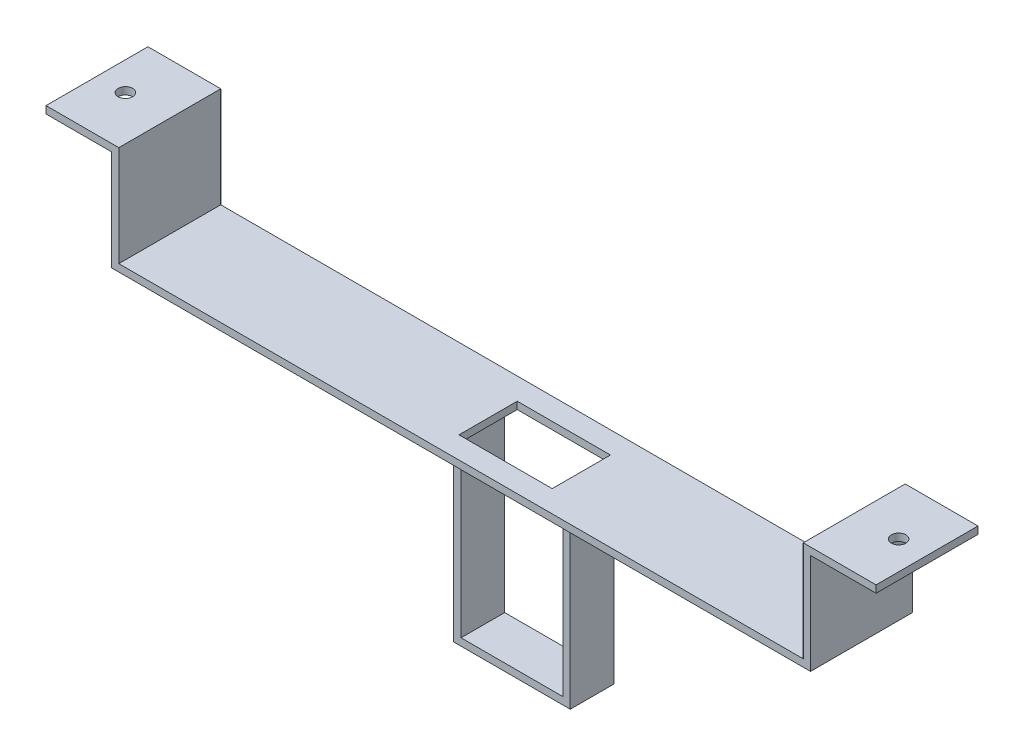
ISO-10303-21;
HEADER;
FILE_DESCRIPTION(('STEP AP214'),'2;1');
FILE_NAME('part.step','',(''),(''),'','','');
FILE_SCHEMA(('AUTOMOTIVE_DESIGN { 1 0 10303 214 1 1 1 1 }'));
ENDSEC;
DATA;
#1=APPLICATION_CONTEXT('core data for automotive mechanical design processes');
#2=APPLICATION_PROTOCOL_DEFINITION('international standard','automotive_design',2000,#1);
#3=PRODUCT_CONTEXT('',#1,'mechanical');
#4=PRODUCT('Part','Part','',(#3));
#5=PRODUCT_RELATED_PRODUCT_CATEGORY('part','',(#4));
#6=PRODUCT_DEFINITION_FORMATION('','',#4);
#7=PRODUCT_DEFINITION_CONTEXT('part definition',#1,'design');
#8=PRODUCT_DEFINITION('design','',#6,#7);
#9=PRODUCT_DEFINITION_SHAPE('','',#8);
#10=(LENGTH_UNIT() NAMED_UNIT(*) SI_UNIT(.MILLI.,.METRE.));
#11=(NAMED_UNIT(*) PLANE_ANGLE_UNIT() SI_UNIT($,.RADIAN.));
#12=(NAMED_UNIT(*) SI_UNIT($,.STERADIAN.) SOLID_ANGLE_UNIT());
#13=UNCERTAINTY_MEASURE_WITH_UNIT(LENGTH_MEASURE(1.E-05),#10,'distance_accuracy_value','');
#14=(GEOMETRIC_REPRESENTATION_CONTEXT(3) GLOBAL_UNCERTAINTY_ASSIGNED_CONTEXT((#13)) GLOBAL_UNIT_ASSIGNED_CONTEXT((#10,
#11,#12)) REPRESENTATION_CONTEXT('',''));
#15=CARTESIAN_POINT('',(0.,0.,0.));
#16=DIRECTION('',(0.,0.,1.));
#17=DIRECTION('',(1.,0.,0.));
#18=AXIS2_PLACEMENT_3D('',#15,#16,#17);
#19=CARTESIAN_POINT('',(0.,-2.5,35.));
#20=DIRECTION('',(0.,1.,0.));
#21=DIRECTION('',(0.,0.,1.));
#22=AXIS2_PLACEMENT_3D('',#19,#20,#21);
#23=PLANE('',#22);
#24=DIRECTION('',(1.,0.,0.));
#25=VECTOR('',#24,1.);
#26=CARTESIAN_POINT('',(-12.5,-2.5,25.));
#27=LINE('',#26,#25);
#28=CARTESIAN_POINT('',(-12.5,-2.5,25.));
#29=VERTEX_POINT('',#28);
#30=CARTESIAN_POINT('',(-10.,-2.5,25.));
#31=VERTEX_POINT('',#30);
#32=EDGE_CURVE('E217',#29,#31,#27,.T.);
#33=ORIENTED_EDGE('',*,*,#32,.T.);
#34=DIRECTION('',(0.,0.,-1.));
#35=VECTOR('',#34,1.);
#36=CARTESIAN_POINT('',(-10.,-2.5,25.));
#37=LINE('',#36,#35);
#38=CARTESIAN_POINT('',(-10.,-2.5,10.));
#39=VERTEX_POINT('',#38);
#40=EDGE_CURVE('E201',#31,#39,#37,.T.);
#41=ORIENTED_EDGE('',*,*,#40,.T.);
#42=DIRECTION('',(1.,0.,0.));
#43=VECTOR('',#42,1.);
#44=CARTESIAN_POINT('',(-12.5,-2.5,10.));
#45=LINE('',#44,#43);
#46=CARTESIAN_POINT('',(-12.5,-2.5,10.));
#47=VERTEX_POINT('',#46);
#48=EDGE_CURVE('E240',#47,#39,#45,.T.);
#49=ORIENTED_EDGE('',*,*,#48,.F.);
#50=DIRECTION('',(0.,0.,-1.));
#51=VECTOR('',#50,1.);
#52=CARTESIAN_POINT('',(-12.5,-2.5,25.));
#53=LINE('',#52,#51);
#54=EDGE_CURVE('E223',#29,#47,#53,.T.);
#55=ORIENTED_EDGE('',*,*,#54,.F.);
#56=EDGE_LOOP('',(#33,#41,#49,#55));
#57=FACE_BOUND('',#56,.T.);
#58=DIRECTION('',(-1.,0.,0.));
#59=VECTOR('',#58,1.);
#60=CARTESIAN_POINT('',(0.,-2.5,7.5));
#61=LINE('',#60,#59);
#62=CARTESIAN_POINT('',(23.8,-2.50000000000002,7.5));
#63=VERTEX_POINT('',#62);
#64=CARTESIAN_POINT('',(-8.20000000000001,-2.50000000000002,7.5));
#65=VERTEX_POINT('',#64);
#66=EDGE_CURVE('E46',#63,#65,#61,.T.);
#67=ORIENTED_EDGE('',*,*,#66,.T.);
#68=DIRECTION('',(0.,0.,1.));
#69=VECTOR('',#68,1.);
#70=CARTESIAN_POINT('',(-8.20000000000001,-2.5,35.));
#71=LINE('',#70,#69);
#72=CARTESIAN_POINT('',(-8.20000000000001,-2.50000000000002,27.5));
#73=VERTEX_POINT('',#72);
#74=EDGE_CURVE('E11',#65,#73,#71,.T.);
#75=ORIENTED_EDGE('',*,*,#74,.T.);
#76=DIRECTION('',(1.,0.,0.));
#77=VECTOR('',#76,1.);
#78=CARTESIAN_POINT('',(0.,-2.5,27.5));
#79=LINE('',#78,#77);
#80=CARTESIAN_POINT('',(23.8,-2.5,27.5));
#81=VERTEX_POINT('',#80);
#82=EDGE_CURVE('E387',#73,#81,#79,.T.);
#83=ORIENTED_EDGE('',*,*,#82,.T.);
#84=DIRECTION('',(0.,0.,-1.));
#85=VECTOR('',#84,1.);
#86=CARTESIAN_POINT('',(23.8,-2.5,35.));
#87=LINE('',#86,#85);
#88=EDGE_CURVE('E390',#81,#63,#87,.T.);
#89=ORIENTED_EDGE('',*,*,#88,.T.);
#90=EDGE_LOOP('',(#67,#75,#83,#89));
#91=FACE_BOUND('',#90,.T.);
#92=DIRECTION('',(1.,0.,0.));
#93=VECTOR('',#92,1.);
#94=CARTESIAN_POINT('',(0.,-2.5,0.));
#95=LINE('',#94,#93);
#96=CARTESIAN_POINT('',(-120.,-2.5,0.));
#97=VERTEX_POINT('',#96);
#98=CARTESIAN_POINT('',(120.,-2.5,0.));
#99=VERTEX_POINT('',#98);
#100=EDGE_CURVE('E347',#97,#99,#95,.T.);
#101=ORIENTED_EDGE('',*,*,#100,.T.);
#102=DIRECTION('',(0.,0.,-1.));
#103=VECTOR('',#102,1.);
#104=CARTESIAN_POINT('',(120.,-2.5,35.));
#105=LINE('',#104,#103);
#106=CARTESIAN_POINT('',(120.,-2.5,35.));
#107=VERTEX_POINT('',#106);
#108=EDGE_CURVE('E372',#107,#99,#105,.T.);
#109=ORIENTED_EDGE('',*,*,#108,.F.);
#110=DIRECTION('',(1.,0.,0.));
#111=VECTOR('',#110,1.);
#112=CARTESIAN_POINT('',(0.,-2.5,35.));
#113=LINE('',#112,#111);
#114=CARTESIAN_POINT('',(-120.,-2.5,35.));
#115=VERTEX_POINT('',#114);
#116=EDGE_CURVE('E314',#115,#107,#113,.T.);
#117=ORIENTED_EDGE('',*,*,#116,.F.);
#118=DIRECTION('',(0.,0.,-1.));
#119=VECTOR('',#118,1.);
#120=CARTESIAN_POINT('',(-120.,-2.5,35.));
#121=LINE('',#120,#119);
#122=EDGE_CURVE('E375',#115,#97,#121,.T.);
#123=ORIENTED_EDGE('',*,*,#122,.T.);
#124=EDGE_LOOP('',(#101,#109,#117,#123));
#125=FACE_BOUND('',#124,.T.);
#126=DIRECTION('',(1.,0.,0.));
#127=VECTOR('',#126,1.);
#128=CARTESIAN_POINT('',(25.,-2.5,25.));
#129=LINE('',#128,#127);
#130=CARTESIAN_POINT('',(25.,-2.5,25.));
#131=VERTEX_POINT('',#130);
#132=CARTESIAN_POINT('',(27.5,-2.5,25.));
#133=VERTEX_POINT('',#132);
#134=EDGE_CURVE('E231',#131,#133,#129,.T.);
#135=ORIENTED_EDGE('',*,*,#134,.T.);
#136=DIRECTION('',(0.,0.,-1.));
#137=VECTOR('',#136,1.);
#138=CARTESIAN_POINT('',(27.5,-2.5,25.));
#139=LINE('',#138,#137);
#140=CARTESIAN_POINT('',(27.5,-2.5,10.));
#141=VERTEX_POINT('',#140);
#142=EDGE_CURVE('E260',#133,#141,#139,.T.);
#143=ORIENTED_EDGE('',*,*,#142,.T.);
#144=DIRECTION('',(1.,0.,0.));
#145=VECTOR('',#144,1.);
#146=CARTESIAN_POINT('',(25.,-2.5,10.));
#147=LINE('',#146,#145);
#148=CARTESIAN_POINT('',(25.,-2.5,10.));
#149=VERTEX_POINT('',#148);
#150=EDGE_CURVE('E246',#149,#141,#147,.T.);
#151=ORIENTED_EDGE('',*,*,#150,.F.);
#152=DIRECTION('',(0.,0.,-1.));
#153=VECTOR('',#152,1.);
#154=CARTESIAN_POINT('',(25.,-2.5,25.));
#155=LINE('',#154,#153);
#156=EDGE_CURVE('E263',#131,#149,#155,.T.);
#157=ORIENTED_EDGE('',*,*,#156,.F.);
#158=EDGE_LOOP('',(#135,#143,#151,#157));
#159=FACE_BOUND('',#158,.T.);
#160=ADVANCED_FACE('F37',(#57,#91,#125,#159),#23,.F.);
#161=CARTESIAN_POINT('',(0.,0.,35.));
#162=DIRECTION('',(0.,1.,0.));
#163=DIRECTION('',(0.,0.,1.));
#164=AXIS2_PLACEMENT_3D('',#161,#162,#163);
#165=PLANE('',#164);
#166=DIRECTION('',(0.,0.,1.));
#167=VECTOR('',#166,1.);
#168=CARTESIAN_POINT('',(-8.20000000000001,0.,35.));
#169=LINE('',#168,#167);
#170=CARTESIAN_POINT('',(-8.20000000000001,0.,7.5));
#171=VERTEX_POINT('',#170);
#172=CARTESIAN_POINT('',(-8.20000000000001,0.,27.5));
#173=VERTEX_POINT('',#172);
#174=EDGE_CURVE('E293',#171,#173,#169,.T.);
#175=ORIENTED_EDGE('',*,*,#174,.F.);
#176=DIRECTION('',(-1.,0.,0.));
#177=VECTOR('',#176,1.);
#178=CARTESIAN_POINT('',(0.,0.,7.5));
#179=LINE('',#178,#177);
#180=CARTESIAN_POINT('',(23.8,0.,7.5));
#181=VERTEX_POINT('',#180);
#182=EDGE_CURVE('E291',#181,#171,#179,.T.);
#183=ORIENTED_EDGE('',*,*,#182,.F.);
#184=DIRECTION('',(0.,0.,-1.));
#185=VECTOR('',#184,1.);
#186=CARTESIAN_POINT('',(23.8,0.,35.));
#187=LINE('',#186,#185);
#188=CARTESIAN_POINT('',(23.8,0.,27.5));
#189=VERTEX_POINT('',#188);
#190=EDGE_CURVE('E289',#189,#181,#187,.T.);
#191=ORIENTED_EDGE('',*,*,#190,.F.);
#192=DIRECTION('',(1.,0.,0.));
#193=VECTOR('',#192,1.);
#194=CARTESIAN_POINT('',(0.,0.,27.5));
#195=LINE('',#194,#193);
#196=EDGE_CURVE('E279',#173,#189,#195,.T.);
#197=ORIENTED_EDGE('',*,*,#196,.F.);
#198=EDGE_LOOP('',(#175,#183,#191,#197));
#199=FACE_BOUND('',#198,.T.);
#200=DIRECTION('',(1.,0.,0.));
#201=VECTOR('',#200,1.);
#202=CARTESIAN_POINT('',(0.,0.,0.));
#203=LINE('',#202,#201);
#204=CARTESIAN_POINT('',(-117.5,0.,0.));
#205=VERTEX_POINT('',#204);
#206=CARTESIAN_POINT('',(117.5,0.,0.));
#207=VERTEX_POINT('',#206);
#208=EDGE_CURVE('E296',#205,#207,#203,.T.);
#209=ORIENTED_EDGE('',*,*,#208,.F.);
#210=DIRECTION('',(0.,0.,-1.));
#211=VECTOR('',#210,1.);
#212=CARTESIAN_POINT('',(-117.5,0.,35.));
#213=LINE('',#212,#211);
#214=CARTESIAN_POINT('',(-117.5,0.,35.));
#215=VERTEX_POINT('',#214);
#216=EDGE_CURVE('E385',#215,#205,#213,.T.);
#217=ORIENTED_EDGE('',*,*,#216,.F.);
#218=DIRECTION('',(1.,0.,0.));
#219=VECTOR('',#218,1.);
#220=CARTESIAN_POINT('',(0.,0.,35.));
#221=LINE('',#220,#219);
#222=CARTESIAN_POINT('',(117.5,0.,35.));
#223=VERTEX_POINT('',#222);
#224=EDGE_CURVE('E297',#215,#223,#221,.T.);
#225=ORIENTED_EDGE('',*,*,#224,.T.);
#226=DIRECTION('',(0.,0.,-1.));
#227=VECTOR('',#226,1.);
#228=CARTESIAN_POINT('',(117.5,0.,35.));
#229=LINE('',#228,#227);
#230=EDGE_CURVE('E329',#223,#207,#229,.T.);
#231=ORIENTED_EDGE('',*,*,#230,.T.);
#232=EDGE_LOOP('',(#209,#217,#225,#231));
#233=FACE_BOUND('',#232,.T.);
#234=ADVANCED_FACE('F39',(#199,#233),#165,.T.);
#235=CARTESIAN_POINT('',(-117.5,0.,35.));
#236=DIRECTION('',(-1.,0.,0.));
#237=DIRECTION('',(0.,0.,1.));
#238=AXIS2_PLACEMENT_3D('',#235,#236,#237);
#239=PLANE('',#238);
#240=DIRECTION('',(0.,1.,0.));
#241=VECTOR('',#240,1.);
#242=CARTESIAN_POINT('',(-117.5,0.,0.));
#243=LINE('',#242,#241);
#244=CARTESIAN_POINT('',(-117.5,34.5,0.));
#245=VERTEX_POINT('',#244);
#246=EDGE_CURVE('E332',#205,#245,#243,.T.);
#247=ORIENTED_EDGE('',*,*,#246,.T.);
#248=DIRECTION('',(0.,0.,-1.));
#249=VECTOR('',#248,1.);
#250=CARTESIAN_POINT('',(-117.5,34.5,35.));
#251=LINE('',#250,#249);
#252=CARTESIAN_POINT('',(-117.5,34.5,35.));
#253=VERTEX_POINT('',#252);
#254=EDGE_CURVE('E383',#253,#245,#251,.T.);
#255=ORIENTED_EDGE('',*,*,#254,.F.);
#256=DIRECTION('',(0.,1.,0.));
#257=VECTOR('',#256,1.);
#258=CARTESIAN_POINT('',(-117.5,0.,35.));
#259=LINE('',#258,#257);
#260=EDGE_CURVE('E300',#215,#253,#259,.T.);
#261=ORIENTED_EDGE('',*,*,#260,.F.);
#262=ORIENTED_EDGE('',*,*,#216,.T.);
#263=EDGE_LOOP('',(#247,#255,#261,#262));
#264=FACE_BOUND('',#263,.T.);
#265=ADVANCED_FACE('F430',(#264),#239,.F.);
#266=CARTESIAN_POINT('',(0.,34.5,35.));
#267=DIRECTION('',(0.,1.,0.));
#268=DIRECTION('',(0.,0.,1.));
#269=AXIS2_PLACEMENT_3D('',#266,#267,#268);
#270=PLANE('',#269);
#271=CARTESIAN_POINT('',(-132.75,34.5,17.5));
#272=DIRECTION('',(0.,1.,0.));
#273=DIRECTION('',(0.,0.,1.));
#274=AXIS2_PLACEMENT_3D('',#271,#272,#273);
#275=CIRCLE('',#274,2.5);
#276=CARTESIAN_POINT('',(-132.75,34.5,20.));
#277=VERTEX_POINT('',#276);
#278=EDGE_CURVE('E268',#277,#277,#275,.T.);
#279=ORIENTED_EDGE('',*,*,#278,.F.);
#280=EDGE_LOOP('',(#279));
#281=FACE_BOUND('',#280,.T.);
#282=DIRECTION('',(1.,0.,0.));
#283=VECTOR('',#282,1.);
#284=CARTESIAN_POINT('',(0.,34.5,0.));
#285=LINE('',#284,#283);
#286=CARTESIAN_POINT('',(-142.5,34.5,0.));
#287=VERTEX_POINT('',#286);
#288=EDGE_CURVE('E335',#287,#245,#285,.T.);
#289=ORIENTED_EDGE('',*,*,#288,.F.);
#290=DIRECTION('',(0.,0.,-1.));
#291=VECTOR('',#290,1.);
#292=CARTESIAN_POINT('',(-142.5,34.5,35.));
#293=LINE('',#292,#291);
#294=CARTESIAN_POINT('',(-142.5,34.5,35.));
#295=VERTEX_POINT('',#294);
#296=EDGE_CURVE('E381',#295,#287,#293,.T.);
#297=ORIENTED_EDGE('',*,*,#296,.F.);
#298=DIRECTION('',(1.,0.,0.));
#299=VECTOR('',#298,1.);
#300=CARTESIAN_POINT('',(0.,34.5,35.));
#301=LINE('',#300,#299);
#302=EDGE_CURVE('E303',#295,#253,#301,.T.);
#303=ORIENTED_EDGE('',*,*,#302,.T.);
#304=ORIENTED_EDGE('',*,*,#254,.T.);
#305=EDGE_LOOP('',(#289,#297,#303,#304));
#306=FACE_BOUND('',#305,.T.);
#307=ADVANCED_FACE('F446',(#281,#306),#270,.T.);
#308=CARTESIAN_POINT('',(-142.5,-1.58206781009084E-12,35.));
#309=DIRECTION('',(1.,0.,0.));
#310=DIRECTION('',(0.,1.,0.));
#311=AXIS2_PLACEMENT_3D('',#308,#309,#310);
#312=PLANE('',#311);
#313=DIRECTION('',(0.,-1.,0.));
#314=VECTOR('',#313,1.);
#315=CARTESIAN_POINT('',(-142.5,-1.58206781009084E-12,0.));
#316=LINE('',#315,#314);
#317=CARTESIAN_POINT('',(-142.5,32.,0.));
#318=VERTEX_POINT('',#317);
#319=EDGE_CURVE('E338',#287,#318,#316,.T.);
#320=ORIENTED_EDGE('',*,*,#319,.T.);
#321=DIRECTION('',(0.,0.,-1.));
#322=VECTOR('',#321,1.);
#323=CARTESIAN_POINT('',(-142.5,32.,35.));
#324=LINE('',#323,#322);
#325=CARTESIAN_POINT('',(-142.5,32.,35.));
#326=VERTEX_POINT('',#325);
#327=EDGE_CURVE('E379',#326,#318,#324,.T.);
#328=ORIENTED_EDGE('',*,*,#327,.F.);
#329=DIRECTION('',(0.,-1.,0.));
#330=VECTOR('',#329,1.);
#331=CARTESIAN_POINT('',(-142.5,-1.58206781009084E-12,35.));
#332=LINE('',#331,#330);
#333=EDGE_CURVE('E306',#295,#326,#332,.T.);
#334=ORIENTED_EDGE('',*,*,#333,.F.);
#335=ORIENTED_EDGE('',*,*,#296,.T.);
#336=EDGE_LOOP('',(#320,#328,#334,#335));
#337=FACE_BOUND('',#336,.T.);
#338=ADVANCED_FACE('F442',(#337),#312,.F.);
#339=CARTESIAN_POINT('',(0.,32.,35.));
#340=DIRECTION('',(0.,-1.,0.));
#341=DIRECTION('',(0.,0.,-1.));
#342=AXIS2_PLACEMENT_3D('',#339,#340,#341);
#343=PLANE('',#342);
#344=CARTESIAN_POINT('',(-132.75,32.,17.5));
#345=DIRECTION('',(0.,-1.,0.));
#346=DIRECTION('',(0.,0.,-1.));
#347=AXIS2_PLACEMENT_3D('',#344,#345,#346);
#348=CIRCLE('',#347,2.5);
#349=CARTESIAN_POINT('',(-132.75,32.,15.));
#350=VERTEX_POINT('',#349);
#351=EDGE_CURVE('E41',#350,#350,#348,.T.);
#352=ORIENTED_EDGE('',*,*,#351,.F.);
#353=EDGE_LOOP('',(#352));
#354=FACE_BOUND('',#353,.T.);
#355=DIRECTION('',(-1.,0.,0.));
#356=VECTOR('',#355,1.);
#357=CARTESIAN_POINT('',(0.,32.,0.));
#358=LINE('',#357,#356);
#359=CARTESIAN_POINT('',(-120.,32.,0.));
#360=VERTEX_POINT('',#359);
#361=EDGE_CURVE('E341',#360,#318,#358,.T.);
#362=ORIENTED_EDGE('',*,*,#361,.F.);
#363=DIRECTION('',(0.,0.,-1.));
#364=VECTOR('',#363,1.);
#365=CARTESIAN_POINT('',(-120.,32.,35.));
#366=LINE('',#365,#364);
#367=CARTESIAN_POINT('',(-120.,32.,35.));
#368=VERTEX_POINT('',#367);
#369=EDGE_CURVE('E377',#368,#360,#366,.T.);
#370=ORIENTED_EDGE('',*,*,#369,.F.);
#371=DIRECTION('',(-1.,0.,0.));
#372=VECTOR('',#371,1.);
#373=CARTESIAN_POINT('',(0.,32.,35.));
#374=LINE('',#373,#372);
#375=EDGE_CURVE('E308',#368,#326,#374,.T.);
#376=ORIENTED_EDGE('',*,*,#375,.T.);
#377=ORIENTED_EDGE('',*,*,#327,.T.);
#378=EDGE_LOOP('',(#362,#370,#376,#377));
#379=FACE_BOUND('',#378,.T.);
#380=ADVANCED_FACE('F438',(#354,#379),#343,.T.);
#381=CARTESIAN_POINT('',(-120.,1.44811698864151E-13,35.));
#382=DIRECTION('',(-1.,0.,0.));
#383=DIRECTION('',(0.,-1.,0.));
#384=AXIS2_PLACEMENT_3D('',#381,#382,#383);
#385=PLANE('',#384);
#386=DIRECTION('',(0.,1.,0.));
#387=VECTOR('',#386,1.);
#388=CARTESIAN_POINT('',(-120.,1.44811698864151E-13,0.));
#389=LINE('',#388,#387);
#390=EDGE_CURVE('E344',#97,#360,#389,.T.);
#391=ORIENTED_EDGE('',*,*,#390,.F.);
#392=ORIENTED_EDGE('',*,*,#122,.F.);
#393=DIRECTION('',(0.,1.,0.));
#394=VECTOR('',#393,1.);
#395=CARTESIAN_POINT('',(-120.,1.44811698864151E-13,35.));
#396=LINE('',#395,#394);
#397=EDGE_CURVE('E311',#115,#368,#396,.T.);
#398=ORIENTED_EDGE('',*,*,#397,.T.);
#399=ORIENTED_EDGE('',*,*,#369,.T.);
#400=EDGE_LOOP('',(#391,#392,#398,#399));
#401=FACE_BOUND('',#400,.T.);
#402=ADVANCED_FACE('F435',(#401),#385,.T.);
#403=CARTESIAN_POINT('',(120.,2.89623397728302E-13,35.));
#404=DIRECTION('',(-1.,0.,0.));
#405=DIRECTION('',(0.,-1.,0.));
#406=AXIS2_PLACEMENT_3D('',#403,#404,#405);
#407=PLANE('',#406);
#408=DIRECTION('',(0.,1.,0.));
#409=VECTOR('',#408,1.);
#410=CARTESIAN_POINT('',(120.,2.89623397728302E-13,0.));
#411=LINE('',#410,#409);
#412=CARTESIAN_POINT('',(120.,32.,0.));
#413=VERTEX_POINT('',#412);
#414=EDGE_CURVE('E349',#99,#413,#411,.T.);
#415=ORIENTED_EDGE('',*,*,#414,.T.);
#416=DIRECTION('',(0.,0.,-1.));
#417=VECTOR('',#416,1.);
#418=CARTESIAN_POINT('',(120.,32.,35.));
#419=LINE('',#418,#417);
#420=CARTESIAN_POINT('',(120.,32.,35.));
#421=VERTEX_POINT('',#420);
#422=EDGE_CURVE('E369',#421,#413,#419,.T.);
#423=ORIENTED_EDGE('',*,*,#422,.F.);
#424=DIRECTION('',(0.,1.,0.));
#425=VECTOR('',#424,1.);
#426=CARTESIAN_POINT('',(120.,2.89623397728302E-13,35.));
#427=LINE('',#426,#425);
#428=EDGE_CURVE('E316',#107,#421,#427,.T.);
#429=ORIENTED_EDGE('',*,*,#428,.F.);
#430=ORIENTED_EDGE('',*,*,#108,.T.);
#431=EDGE_LOOP('',(#415,#423,#429,#430));
#432=FACE_BOUND('',#431,.T.);
#433=ADVANCED_FACE('F433',(#432),#407,.F.);
#434=CARTESIAN_POINT('',(0.,32.,35.));
#435=DIRECTION('',(0.,1.,0.));
#436=DIRECTION('',(0.,0.,1.));
#437=AXIS2_PLACEMENT_3D('',#434,#435,#436);
#438=PLANE('',#437);
#439=CARTESIAN_POINT('',(132.75,32.,17.5000000000003));
#440=DIRECTION('',(0.,1.,0.));
#441=DIRECTION('',(0.,0.,1.));
#442=AXIS2_PLACEMENT_3D('',#439,#440,#441);
#443=CIRCLE('',#442,2.5);
#444=CARTESIAN_POINT('',(132.75,32.,20.0000000000003));
#445=VERTEX_POINT('',#444);
#446=EDGE_CURVE('E271',#445,#445,#443,.T.);
#447=ORIENTED_EDGE('',*,*,#446,.T.);
#448=EDGE_LOOP('',(#447));
#449=FACE_BOUND('',#448,.T.);
#450=DIRECTION('',(1.,0.,0.));
#451=VECTOR('',#450,1.);
#452=CARTESIAN_POINT('',(0.,32.,0.));
#453=LINE('',#452,#451);
#454=CARTESIAN_POINT('',(142.5,32.,0.));
#455=VERTEX_POINT('',#454);
#456=EDGE_CURVE('E351',#413,#455,#453,.T.);
#457=ORIENTED_EDGE('',*,*,#456,.T.);
#458=DIRECTION('',(0.,0.,-1.));
#459=VECTOR('',#458,1.);
#460=CARTESIAN_POINT('',(142.5,32.,35.));
#461=LINE('',#460,#459);
#462=CARTESIAN_POINT('',(142.5,32.,35.));
#463=VERTEX_POINT('',#462);
#464=EDGE_CURVE('E367',#463,#455,#461,.T.);
#465=ORIENTED_EDGE('',*,*,#464,.F.);
#466=DIRECTION('',(1.,0.,0.));
#467=VECTOR('',#466,1.);
#468=CARTESIAN_POINT('',(0.,32.,35.));
#469=LINE('',#468,#467);
#470=EDGE_CURVE('E318',#421,#463,#469,.T.);
#471=ORIENTED_EDGE('',*,*,#470,.F.);
#472=ORIENTED_EDGE('',*,*,#422,.T.);
#473=EDGE_LOOP('',(#457,#465,#471,#472));
#474=FACE_BOUND('',#473,.T.);
#475=ADVANCED_FACE('F487',(#449,#474),#438,.F.);
#476=CARTESIAN_POINT('',(142.499999999999,-4.7462034302725E-12,35.));
#477=DIRECTION('',(1.,0.,0.));
#478=DIRECTION('',(0.,1.,0.));
#479=AXIS2_PLACEMENT_3D('',#476,#477,#478);
#480=PLANE('',#479);
#481=DIRECTION('',(0.,-1.,0.));
#482=VECTOR('',#481,1.);
#483=CARTESIAN_POINT('',(142.499999999999,-4.7462034302725E-12,0.));
#484=LINE('',#483,#482);
#485=CARTESIAN_POINT('',(142.5,34.5,0.));
#486=VERTEX_POINT('',#485);
#487=EDGE_CURVE('E354',#486,#455,#484,.T.);
#488=ORIENTED_EDGE('',*,*,#487,.F.);
#489=DIRECTION('',(0.,0.,-1.));
#490=VECTOR('',#489,1.);
#491=CARTESIAN_POINT('',(142.5,34.5,35.));
#492=LINE('',#491,#490);
#493=CARTESIAN_POINT('',(142.5,34.5,35.));
#494=VERTEX_POINT('',#493);
#495=EDGE_CURVE('E365',#494,#486,#492,.T.);
#496=ORIENTED_EDGE('',*,*,#495,.F.);
#497=DIRECTION('',(0.,-1.,0.));
#498=VECTOR('',#497,1.);
#499=CARTESIAN_POINT('',(142.499999999999,-4.7462034302725E-12,35.));
#500=LINE('',#499,#498);
#501=EDGE_CURVE('E320',#494,#463,#500,.T.);
#502=ORIENTED_EDGE('',*,*,#501,.T.);
#503=ORIENTED_EDGE('',*,*,#464,.T.);
#504=EDGE_LOOP('',(#488,#496,#502,#503));
#505=FACE_BOUND('',#504,.T.);
#506=ADVANCED_FACE('F482',(#505),#480,.T.);
#507=CARTESIAN_POINT('',(0.,34.5,35.));
#508=DIRECTION('',(0.,1.,0.));
#509=DIRECTION('',(0.,0.,1.));
#510=AXIS2_PLACEMENT_3D('',#507,#508,#509);
#511=PLANE('',#510);
#512=CARTESIAN_POINT('',(132.75,34.5,17.5000000000003));
#513=DIRECTION('',(0.,1.,0.));
#514=DIRECTION('',(0.,0.,-1.));
#515=AXIS2_PLACEMENT_3D('',#512,#513,#514);
#516=CIRCLE('',#515,2.5);
#517=CARTESIAN_POINT('',(132.75,34.5,15.0000000000003));
#518=VERTEX_POINT('',#517);
#519=EDGE_CURVE('E254',#518,#518,#516,.T.);
#520=ORIENTED_EDGE('',*,*,#519,.F.);
#521=EDGE_LOOP('',(#520));
#522=FACE_BOUND('',#521,.T.);
#523=DIRECTION('',(1.,0.,0.));
#524=VECTOR('',#523,1.);
#525=CARTESIAN_POINT('',(0.,34.5,0.));
#526=LINE('',#525,#524);
#527=CARTESIAN_POINT('',(117.5,34.5,0.));
#528=VERTEX_POINT('',#527);
#529=EDGE_CURVE('E357',#528,#486,#526,.T.);
#530=ORIENTED_EDGE('',*,*,#529,.F.);
#531=DIRECTION('',(0.,0.,-1.));
#532=VECTOR('',#531,1.);
#533=CARTESIAN_POINT('',(117.5,34.5,35.));
#534=LINE('',#533,#532);
#535=CARTESIAN_POINT('',(117.5,34.5,35.));
#536=VERTEX_POINT('',#535);
#537=EDGE_CURVE('E363',#536,#528,#534,.T.);
#538=ORIENTED_EDGE('',*,*,#537,.F.);
#539=DIRECTION('',(1.,0.,0.));
#540=VECTOR('',#539,1.);
#541=CARTESIAN_POINT('',(0.,34.5,35.));
#542=LINE('',#541,#540);
#543=EDGE_CURVE('E323',#536,#494,#542,.T.);
#544=ORIENTED_EDGE('',*,*,#543,.T.);
#545=ORIENTED_EDGE('',*,*,#495,.T.);
#546=EDGE_LOOP('',(#530,#538,#544,#545));
#547=FACE_BOUND('',#546,.T.);
#548=ADVANCED_FACE('F477',(#522,#547),#511,.T.);
#549=CARTESIAN_POINT('',(117.5,0.,35.));
#550=DIRECTION('',(-1.,0.,0.));
#551=DIRECTION('',(0.,0.,1.));
#552=AXIS2_PLACEMENT_3D('',#549,#550,#551);
#553=PLANE('',#552);
#554=DIRECTION('',(0.,1.,0.));
#555=VECTOR('',#554,1.);
#556=CARTESIAN_POINT('',(117.5,0.,0.));
#557=LINE('',#556,#555);
#558=EDGE_CURVE('E301',#207,#528,#557,.T.);
#559=ORIENTED_EDGE('',*,*,#558,.F.);
#560=ORIENTED_EDGE('',*,*,#230,.F.);
#561=DIRECTION('',(0.,1.,0.));
#562=VECTOR('',#561,1.);
#563=CARTESIAN_POINT('',(117.5,0.,35.));
#564=LINE('',#563,#562);
#565=EDGE_CURVE('E326',#223,#536,#564,.T.);
#566=ORIENTED_EDGE('',*,*,#565,.T.);
#567=ORIENTED_EDGE('',*,*,#537,.T.);
#568=EDGE_LOOP('',(#559,#560,#566,#567));
#569=FACE_BOUND('',#568,.T.);
#570=ADVANCED_FACE('F474',(#569),#553,.T.);
#571=CARTESIAN_POINT('',(0.,0.,35.));
#572=DIRECTION('',(0.,0.,1.));
#573=DIRECTION('',(1.,0.,0.));
#574=AXIS2_PLACEMENT_3D('',#571,#572,#573);
#575=PLANE('',#574);
#576=ORIENTED_EDGE('',*,*,#224,.F.);
#577=ORIENTED_EDGE('',*,*,#260,.T.);
#578=ORIENTED_EDGE('',*,*,#302,.F.);
#579=ORIENTED_EDGE('',*,*,#333,.T.);
#580=ORIENTED_EDGE('',*,*,#375,.F.);
#581=ORIENTED_EDGE('',*,*,#397,.F.);
#582=ORIENTED_EDGE('',*,*,#116,.T.);
#583=ORIENTED_EDGE('',*,*,#428,.T.);
#584=ORIENTED_EDGE('',*,*,#470,.T.);
#585=ORIENTED_EDGE('',*,*,#501,.F.);
#586=ORIENTED_EDGE('',*,*,#543,.F.);
#587=ORIENTED_EDGE('',*,*,#565,.F.);
#588=EDGE_LOOP('',(#576,#577,#578,#579,#580,#581,#582,#583,#584,#585,#586,#587));
#589=FACE_BOUND('',#588,.T.);
#590=ADVANCED_FACE('F467',(#589),#575,.T.);
#591=CARTESIAN_POINT('',(0.,0.,0.));
#592=DIRECTION('',(0.,0.,1.));
#593=DIRECTION('',(1.,0.,0.));
#594=AXIS2_PLACEMENT_3D('',#591,#592,#593);
#595=PLANE('',#594);
#596=ORIENTED_EDGE('',*,*,#208,.T.);
#597=ORIENTED_EDGE('',*,*,#558,.T.);
#598=ORIENTED_EDGE('',*,*,#529,.T.);
#599=ORIENTED_EDGE('',*,*,#487,.T.);
#600=ORIENTED_EDGE('',*,*,#456,.F.);
#601=ORIENTED_EDGE('',*,*,#414,.F.);
#602=ORIENTED_EDGE('',*,*,#100,.F.);
#603=ORIENTED_EDGE('',*,*,#390,.T.);
#604=ORIENTED_EDGE('',*,*,#361,.T.);
#605=ORIENTED_EDGE('',*,*,#319,.F.);
#606=ORIENTED_EDGE('',*,*,#288,.T.);
#607=ORIENTED_EDGE('',*,*,#246,.F.);
#608=EDGE_LOOP('',(#596,#597,#598,#599,#600,#601,#602,#603,#604,#605,#606,#607));
#609=FACE_BOUND('',#608,.T.);
#610=ADVANCED_FACE('F461',(#609),#595,.F.);
#611=CARTESIAN_POINT('',(-8.20000000000001,-55.5,7.5));
#612=DIRECTION('',(-1.,0.,0.));
#613=DIRECTION('',(0.,0.,1.));
#614=AXIS2_PLACEMENT_3D('',#611,#612,#613);
#615=PLANE('',#614);
#616=ORIENTED_EDGE('',*,*,#174,.T.);
#617=DIRECTION('',(0.,1.,0.));
#618=VECTOR('',#617,1.);
#619=CARTESIAN_POINT('',(-8.20000000000001,-55.5,27.5));
#620=LINE('',#619,#618);
#621=EDGE_CURVE('E286',#73,#173,#620,.T.);
#622=ORIENTED_EDGE('',*,*,#621,.F.);
#623=ORIENTED_EDGE('',*,*,#74,.F.);
#624=DIRECTION('',(0.,1.,0.));
#625=VECTOR('',#624,1.);
#626=CARTESIAN_POINT('',(-8.20000000000001,-55.5,7.5));
#627=LINE('',#626,#625);
#628=EDGE_CURVE('E276',#65,#171,#627,.T.);
#629=ORIENTED_EDGE('',*,*,#628,.T.);
#630=EDGE_LOOP('',(#616,#622,#623,#629));
#631=FACE_BOUND('',#630,.T.);
#632=ADVANCED_FACE('F409',(#631),#615,.F.);
#633=CARTESIAN_POINT('',(-8.20000000000001,-55.5,7.5));
#634=DIRECTION('',(0.,0.,-1.));
#635=DIRECTION('',(-1.,0.,0.));
#636=AXIS2_PLACEMENT_3D('',#633,#634,#635);
#637=PLANE('',#636);
#638=ORIENTED_EDGE('',*,*,#182,.T.);
#639=ORIENTED_EDGE('',*,*,#628,.F.);
#640=ORIENTED_EDGE('',*,*,#66,.F.);
#641=DIRECTION('',(0.,1.,0.));
#642=VECTOR('',#641,1.);
#643=CARTESIAN_POINT('',(23.8,-55.5,7.5));
#644=LINE('',#643,#642);
#645=EDGE_CURVE('E280',#63,#181,#644,.T.);
#646=ORIENTED_EDGE('',*,*,#645,.T.);
#647=EDGE_LOOP('',(#638,#639,#640,#646));
#648=FACE_BOUND('',#647,.T.);
#649=ADVANCED_FACE('F399',(#648),#637,.F.);
#650=CARTESIAN_POINT('',(23.8,-55.5,7.5));
#651=DIRECTION('',(1.,0.,0.));
#652=DIRECTION('',(0.,0.,-1.));
#653=AXIS2_PLACEMENT_3D('',#650,#651,#652);
#654=PLANE('',#653);
#655=ORIENTED_EDGE('',*,*,#190,.T.);
#656=ORIENTED_EDGE('',*,*,#645,.F.);
#657=ORIENTED_EDGE('',*,*,#88,.F.);
#658=DIRECTION('',(0.,1.,0.));
#659=VECTOR('',#658,1.);
#660=CARTESIAN_POINT('',(23.8,-55.5,27.5));
#661=LINE('',#660,#659);
#662=EDGE_CURVE('E283',#81,#189,#661,.T.);
#663=ORIENTED_EDGE('',*,*,#662,.T.);
#664=EDGE_LOOP('',(#655,#656,#657,#663));
#665=FACE_BOUND('',#664,.T.);
#666=ADVANCED_FACE('F402',(#665),#654,.F.);
#667=CARTESIAN_POINT('',(-8.20000000000001,-55.5,27.5));
#668=DIRECTION('',(0.,0.,1.));
#669=DIRECTION('',(1.,0.,0.));
#670=AXIS2_PLACEMENT_3D('',#667,#668,#669);
#671=PLANE('',#670);
#672=ORIENTED_EDGE('',*,*,#196,.T.);
#673=ORIENTED_EDGE('',*,*,#662,.F.);
#674=ORIENTED_EDGE('',*,*,#82,.F.);
#675=ORIENTED_EDGE('',*,*,#621,.T.);
#676=EDGE_LOOP('',(#672,#673,#674,#675));
#677=FACE_BOUND('',#676,.T.);
#678=ADVANCED_FACE('F412',(#677),#671,.F.);
#679=CARTESIAN_POINT('',(132.75,-55.5,17.5000000000003));
#680=DIRECTION('',(0.,1.,0.));
#681=DIRECTION('',(0.,0.,1.));
#682=AXIS2_PLACEMENT_3D('',#679,#680,#681);
#683=CYLINDRICAL_SURFACE('',#682,2.5);
#684=ORIENTED_EDGE('',*,*,#519,.T.);
#685=EDGE_LOOP('',(#684));
#686=FACE_BOUND('',#685,.T.);
#687=ORIENTED_EDGE('',*,*,#446,.F.);
#688=EDGE_LOOP('',(#687));
#689=FACE_BOUND('',#688,.T.);
#690=ADVANCED_FACE('F414',(#686,#689),#683,.F.);
#691=CARTESIAN_POINT('',(-132.75,-55.5,17.5));
#692=DIRECTION('',(0.,1.,0.));
#693=DIRECTION('',(0.,0.,1.));
#694=AXIS2_PLACEMENT_3D('',#691,#692,#693);
#695=CYLINDRICAL_SURFACE('',#694,2.5);
#696=ORIENTED_EDGE('',*,*,#351,.T.);
#697=EDGE_LOOP('',(#696));
#698=FACE_BOUND('',#697,.T.);
#699=ORIENTED_EDGE('',*,*,#278,.T.);
#700=EDGE_LOOP('',(#699));
#701=FACE_BOUND('',#700,.T.);
#702=ADVANCED_FACE('F420',(#698,#701),#695,.F.);
#703=CARTESIAN_POINT('',(-12.5,-2.5,25.));
#704=DIRECTION('',(1.,0.,0.));
#705=DIRECTION('',(0.,1.,0.));
#706=AXIS2_PLACEMENT_3D('',#703,#704,#705);
#707=PLANE('',#706);
#708=DIRECTION('',(0.,-1.,0.));
#709=VECTOR('',#708,1.);
#710=CARTESIAN_POINT('',(-12.5,-2.5,10.));
#711=LINE('',#710,#709);
#712=CARTESIAN_POINT('',(-12.5,-65.,10.));
#713=VERTEX_POINT('',#712);
#714=EDGE_CURVE('E60',#47,#713,#711,.T.);
#715=ORIENTED_EDGE('',*,*,#714,.T.);
#716=DIRECTION('',(0.,0.,-1.));
#717=VECTOR('',#716,1.);
#718=CARTESIAN_POINT('',(-12.5,-65.,25.));
#719=LINE('',#718,#717);
#720=CARTESIAN_POINT('',(-12.5,-65.,25.));
#721=VERTEX_POINT('',#720);
#722=EDGE_CURVE('E255',#721,#713,#719,.T.);
#723=ORIENTED_EDGE('',*,*,#722,.F.);
#724=DIRECTION('',(0.,-1.,0.));
#725=VECTOR('',#724,1.);
#726=CARTESIAN_POINT('',(-12.5,-2.5,25.));
#727=LINE('',#726,#725);
#728=EDGE_CURVE('E211',#29,#721,#727,.T.);
#729=ORIENTED_EDGE('',*,*,#728,.F.);
#730=ORIENTED_EDGE('',*,*,#54,.T.);
#731=EDGE_LOOP('',(#715,#723,#729,#730));
#732=FACE_BOUND('',#731,.T.);
#733=ADVANCED_FACE('F516',(#732),#707,.F.);
#734=CARTESIAN_POINT('',(-12.5,-65.,25.));
#735=DIRECTION('',(0.,1.,0.));
#736=DIRECTION('',(0.,0.,1.));
#737=AXIS2_PLACEMENT_3D('',#734,#735,#736);
#738=PLANE('',#737);
#739=DIRECTION('',(1.,0.,0.));
#740=VECTOR('',#739,1.);
#741=CARTESIAN_POINT('',(-12.5,-65.,10.));
#742=LINE('',#741,#740);
#743=CARTESIAN_POINT('',(27.5,-65.,10.));
#744=VERTEX_POINT('',#743);
#745=EDGE_CURVE('E225',#713,#744,#742,.T.);
#746=ORIENTED_EDGE('',*,*,#745,.T.);
#747=DIRECTION('',(0.,0.,-1.));
#748=VECTOR('',#747,1.);
#749=CARTESIAN_POINT('',(27.5,-65.,25.));
#750=LINE('',#749,#748);
#751=CARTESIAN_POINT('',(27.5,-65.,25.));
#752=VERTEX_POINT('',#751);
#753=EDGE_CURVE('E258',#752,#744,#750,.T.);
#754=ORIENTED_EDGE('',*,*,#753,.F.);
#755=DIRECTION('',(1.,0.,0.));
#756=VECTOR('',#755,1.);
#757=CARTESIAN_POINT('',(-12.5,-65.,25.));
#758=LINE('',#757,#756);
#759=EDGE_CURVE('E237',#721,#752,#758,.T.);
#760=ORIENTED_EDGE('',*,*,#759,.F.);
#761=ORIENTED_EDGE('',*,*,#722,.T.);
#762=EDGE_LOOP('',(#746,#754,#760,#761));
#763=FACE_BOUND('',#762,.T.);
#764=ADVANCED_FACE('F519',(#763),#738,.F.);
#765=CARTESIAN_POINT('',(27.5,-2.5,25.));
#766=DIRECTION('',(1.,0.,0.));
#767=DIRECTION('',(0.,1.,0.));
#768=AXIS2_PLACEMENT_3D('',#765,#766,#767);
#769=PLANE('',#768);
#770=DIRECTION('',(0.,-1.,0.));
#771=VECTOR('',#770,1.);
#772=CARTESIAN_POINT('',(27.5,-2.5,10.));
#773=LINE('',#772,#771);
#774=EDGE_CURVE('E248',#141,#744,#773,.T.);
#775=ORIENTED_EDGE('',*,*,#774,.F.);
#776=ORIENTED_EDGE('',*,*,#142,.F.);
#777=DIRECTION('',(0.,-1.,0.));
#778=VECTOR('',#777,1.);
#779=CARTESIAN_POINT('',(27.5,-2.5,25.));
#780=LINE('',#779,#778);
#781=EDGE_CURVE('E234',#133,#752,#780,.T.);
#782=ORIENTED_EDGE('',*,*,#781,.T.);
#783=ORIENTED_EDGE('',*,*,#753,.T.);
#784=EDGE_LOOP('',(#775,#776,#782,#783));
#785=FACE_BOUND('',#784,.T.);
#786=ADVANCED_FACE('F507',(#785),#769,.T.);
#787=CARTESIAN_POINT('',(25.,-2.5,25.));
#788=DIRECTION('',(1.,0.,0.));
#789=DIRECTION('',(0.,1.,0.));
#790=AXIS2_PLACEMENT_3D('',#787,#788,#789);
#791=PLANE('',#790);
#792=DIRECTION('',(0.,-1.,0.));
#793=VECTOR('',#792,1.);
#794=CARTESIAN_POINT('',(25.,-2.5,10.));
#795=LINE('',#794,#793);
#796=CARTESIAN_POINT('',(25.,-62.5,10.));
#797=VERTEX_POINT('',#796);
#798=EDGE_CURVE('E53',#149,#797,#795,.T.);
#799=ORIENTED_EDGE('',*,*,#798,.T.);
#800=DIRECTION('',(0.,0.,-1.));
#801=VECTOR('',#800,1.);
#802=CARTESIAN_POINT('',(25.,-62.5,25.));
#803=LINE('',#802,#801);
#804=CARTESIAN_POINT('',(25.,-62.5,25.));
#805=VERTEX_POINT('',#804);
#806=EDGE_CURVE('E265',#805,#797,#803,.T.);
#807=ORIENTED_EDGE('',*,*,#806,.F.);
#808=DIRECTION('',(0.,-1.,0.));
#809=VECTOR('',#808,1.);
#810=CARTESIAN_POINT('',(25.,-2.5,25.));
#811=LINE('',#810,#809);
#812=EDGE_CURVE('E229',#131,#805,#811,.T.);
#813=ORIENTED_EDGE('',*,*,#812,.F.);
#814=ORIENTED_EDGE('',*,*,#156,.T.);
#815=EDGE_LOOP('',(#799,#807,#813,#814));
#816=FACE_BOUND('',#815,.T.);
#817=ADVANCED_FACE('F526',(#816),#791,.F.);
#818=CARTESIAN_POINT('',(-9.99999999999999,-62.5,25.));
#819=DIRECTION('',(0.,1.,0.));
#820=DIRECTION('',(0.,0.,1.));
#821=AXIS2_PLACEMENT_3D('',#818,#819,#820);
#822=PLANE('',#821);
#823=DIRECTION('',(1.,0.,0.));
#824=VECTOR('',#823,1.);
#825=CARTESIAN_POINT('',(-9.99999999999999,-62.5,10.));
#826=LINE('',#825,#824);
#827=CARTESIAN_POINT('',(-9.99999999999999,-62.5,10.));
#828=VERTEX_POINT('',#827);
#829=EDGE_CURVE('E243',#828,#797,#826,.T.);
#830=ORIENTED_EDGE('',*,*,#829,.F.);
#831=DIRECTION('',(0.,0.,-1.));
#832=VECTOR('',#831,1.);
#833=CARTESIAN_POINT('',(-9.99999999999999,-62.5,25.));
#834=LINE('',#833,#832);
#835=CARTESIAN_POINT('',(-9.99999999999999,-62.5,25.));
#836=VERTEX_POINT('',#835);
#837=EDGE_CURVE('E210',#836,#828,#834,.T.);
#838=ORIENTED_EDGE('',*,*,#837,.F.);
#839=DIRECTION('',(1.,0.,0.));
#840=VECTOR('',#839,1.);
#841=CARTESIAN_POINT('',(-9.99999999999999,-62.5,25.));
#842=LINE('',#841,#840);
#843=EDGE_CURVE('E220',#836,#805,#842,.T.);
#844=ORIENTED_EDGE('',*,*,#843,.T.);
#845=ORIENTED_EDGE('',*,*,#806,.T.);
#846=EDGE_LOOP('',(#830,#838,#844,#845));
#847=FACE_BOUND('',#846,.T.);
#848=ADVANCED_FACE('F529',(#847),#822,.T.);
#849=CARTESIAN_POINT('',(-10.,-2.5,25.));
#850=DIRECTION('',(1.,0.,0.));
#851=DIRECTION('',(0.,1.,0.));
#852=AXIS2_PLACEMENT_3D('',#849,#850,#851);
#853=PLANE('',#852);
#854=DIRECTION('',(0.,-1.,0.));
#855=VECTOR('',#854,1.);
#856=CARTESIAN_POINT('',(-10.,-2.5,10.));
#857=LINE('',#856,#855);
#858=EDGE_CURVE('E206',#39,#828,#857,.T.);
#859=ORIENTED_EDGE('',*,*,#858,.F.);
#860=ORIENTED_EDGE('',*,*,#40,.F.);
#861=DIRECTION('',(0.,-1.,0.));
#862=VECTOR('',#861,1.);
#863=CARTESIAN_POINT('',(-10.,-2.5,25.));
#864=LINE('',#863,#862);
#865=EDGE_CURVE('E204',#31,#836,#864,.T.);
#866=ORIENTED_EDGE('',*,*,#865,.T.);
#867=ORIENTED_EDGE('',*,*,#837,.T.);
#868=EDGE_LOOP('',(#859,#860,#866,#867));
#869=FACE_BOUND('',#868,.T.);
#870=ADVANCED_FACE('F203',(#869),#853,.T.);
#871=CARTESIAN_POINT('',(0.,0.,25.));
#872=DIRECTION('',(0.,0.,-1.));
#873=DIRECTION('',(-1.,0.,0.));
#874=AXIS2_PLACEMENT_3D('',#871,#872,#873);
#875=PLANE('',#874);
#876=ORIENTED_EDGE('',*,*,#32,.F.);
#877=ORIENTED_EDGE('',*,*,#728,.T.);
#878=ORIENTED_EDGE('',*,*,#759,.T.);
#879=ORIENTED_EDGE('',*,*,#781,.F.);
#880=ORIENTED_EDGE('',*,*,#134,.F.);
#881=ORIENTED_EDGE('',*,*,#812,.T.);
#882=ORIENTED_EDGE('',*,*,#843,.F.);
#883=ORIENTED_EDGE('',*,*,#865,.F.);
#884=EDGE_LOOP('',(#876,#877,#878,#879,#880,#881,#882,#883));
#885=FACE_BOUND('',#884,.T.);
#886=ADVANCED_FACE('F216',(#885),#875,.F.);
#887=CARTESIAN_POINT('',(0.,0.,10.));
#888=DIRECTION('',(0.,0.,-1.));
#889=DIRECTION('',(-1.,0.,0.));
#890=AXIS2_PLACEMENT_3D('',#887,#888,#889);
#891=PLANE('',#890);
#892=ORIENTED_EDGE('',*,*,#48,.T.);
#893=ORIENTED_EDGE('',*,*,#858,.T.);
#894=ORIENTED_EDGE('',*,*,#829,.T.);
#895=ORIENTED_EDGE('',*,*,#798,.F.);
#896=ORIENTED_EDGE('',*,*,#150,.T.);
#897=ORIENTED_EDGE('',*,*,#774,.T.);
#898=ORIENTED_EDGE('',*,*,#745,.F.);
#899=ORIENTED_EDGE('',*,*,#714,.F.);
#900=EDGE_LOOP('',(#892,#893,#894,#895,#896,#897,#898,#899));
#901=FACE_BOUND('',#900,.T.);
#902=ADVANCED_FACE('F508',(#901),#891,.T.);
#903=CLOSED_SHELL('',(#160,#234,#265,#307,#338,#380,#402,#433,#475,#506,#548,#570,#590,#610,
#632,#649,#666,#678,#690,#702,#733,#764,#786,#817,#848,#870,#886,#902));
#904=MANIFOLD_SOLID_BREP('B2',#903);
#905=ADVANCED_BREP_SHAPE_REPRESENTATION('',(#18,#904),#14);
#906=SHAPE_DEFINITION_REPRESENTATION(#9,#905);
ENDSEC;
END-ISO-10303-21;
